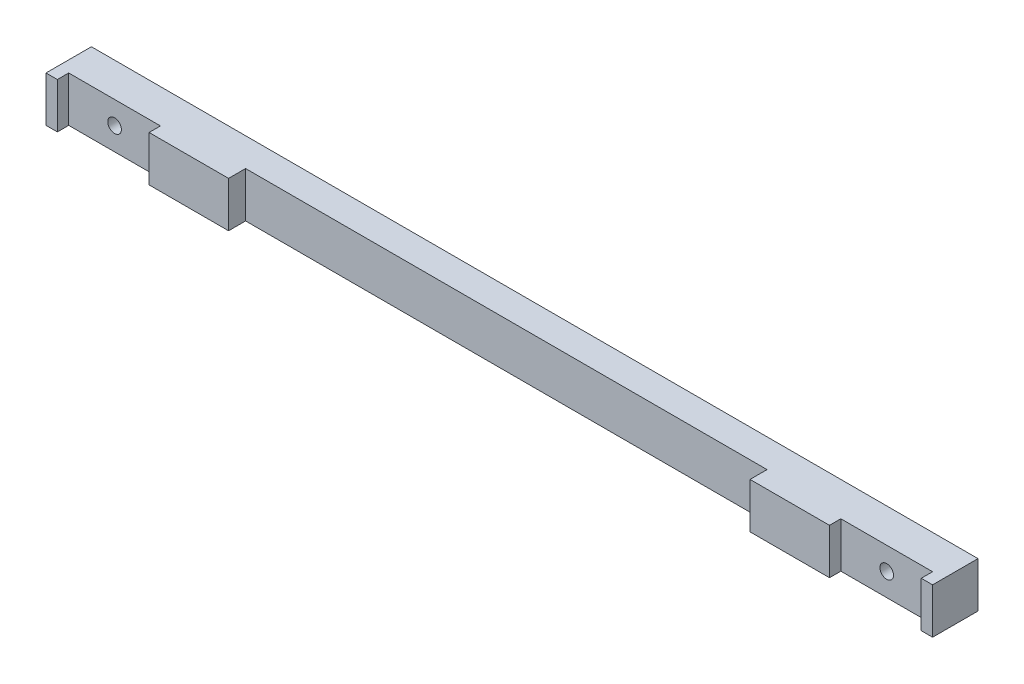
ISO-10303-21;
HEADER;
FILE_DESCRIPTION(('STEP AP214'),'2;1');
FILE_NAME('part.step','',(''),(''),'','','');
FILE_SCHEMA(('AUTOMOTIVE_DESIGN { 1 0 10303 214 1 1 1 1 }'));
ENDSEC;
DATA;
#1=APPLICATION_CONTEXT('core data for automotive mechanical design processes');
#2=APPLICATION_PROTOCOL_DEFINITION('international standard','automotive_design',2000,#1);
#3=PRODUCT_CONTEXT('',#1,'mechanical');
#4=PRODUCT('Part','Part','',(#3));
#5=PRODUCT_RELATED_PRODUCT_CATEGORY('part','',(#4));
#6=PRODUCT_DEFINITION_FORMATION('','',#4);
#7=PRODUCT_DEFINITION_CONTEXT('part definition',#1,'design');
#8=PRODUCT_DEFINITION('design','',#6,#7);
#9=PRODUCT_DEFINITION_SHAPE('','',#8);
#10=(LENGTH_UNIT() NAMED_UNIT(*) SI_UNIT(.MILLI.,.METRE.));
#11=(NAMED_UNIT(*) PLANE_ANGLE_UNIT() SI_UNIT($,.RADIAN.));
#12=(NAMED_UNIT(*) SI_UNIT($,.STERADIAN.) SOLID_ANGLE_UNIT());
#13=UNCERTAINTY_MEASURE_WITH_UNIT(LENGTH_MEASURE(1.E-05),#10,'distance_accuracy_value','');
#14=(GEOMETRIC_REPRESENTATION_CONTEXT(3) GLOBAL_UNCERTAINTY_ASSIGNED_CONTEXT((#13)) GLOBAL_UNIT_ASSIGNED_CONTEXT((#10,
#11,#12)) REPRESENTATION_CONTEXT('',''));
#15=CARTESIAN_POINT('',(0.,0.,0.));
#16=DIRECTION('',(0.,0.,1.));
#17=DIRECTION('',(1.,0.,0.));
#18=AXIS2_PLACEMENT_3D('',#15,#16,#17);
#19=CARTESIAN_POINT('',(0.,0.,12.7));
#20=DIRECTION('',(0.,0.,1.));
#21=DIRECTION('',(1.,0.,0.));
#22=AXIS2_PLACEMENT_3D('',#19,#20,#21);
#23=PLANE('',#22);
#24=DIRECTION('',(0.,-1.,0.));
#25=VECTOR('',#24,1.);
#26=CARTESIAN_POINT('',(-72.9107,-11.2366180876711,12.7));
#27=LINE('',#26,#25);
#28=CARTESIAN_POINT('',(-72.9107,6.35,12.7));
#29=VERTEX_POINT('',#28);
#30=CARTESIAN_POINT('',(-72.9107,-6.35,12.7));
#31=VERTEX_POINT('',#30);
#32=EDGE_CURVE('E156',#29,#31,#27,.T.);
#33=ORIENTED_EDGE('',*,*,#32,.F.);
#34=DIRECTION('',(-1.,0.,0.));
#35=VECTOR('',#34,1.);
#36=CARTESIAN_POINT('',(123.9647,6.35000000000002,12.7));
#37=LINE('',#36,#35);
#38=CARTESIAN_POINT('',(-95.1357,6.35000000000002,12.7));
#39=VERTEX_POINT('',#38);
#40=EDGE_CURVE('E166',#29,#39,#37,.T.);
#41=ORIENTED_EDGE('',*,*,#40,.T.);
#42=DIRECTION('',(0.,1.,0.));
#43=VECTOR('',#42,1.);
#44=CARTESIAN_POINT('',(-95.1357,0.,12.7));
#45=LINE('',#44,#43);
#46=CARTESIAN_POINT('',(-95.1356999999999,-6.35000000000001,12.7));
#47=VERTEX_POINT('',#46);
#48=EDGE_CURVE('E228',#47,#39,#45,.T.);
#49=ORIENTED_EDGE('',*,*,#48,.F.);
#50=DIRECTION('',(1.,0.,0.));
#51=VECTOR('',#50,1.);
#52=CARTESIAN_POINT('',(123.9647,-6.34999999999998,12.7));
#53=LINE('',#52,#51);
#54=EDGE_CURVE('E169',#47,#31,#53,.T.);
#55=ORIENTED_EDGE('',*,*,#54,.T.);
#56=EDGE_LOOP('',(#33,#41,#49,#55));
#57=FACE_BOUND('',#56,.T.);
#58=ADVANCED_FACE('F40',(#57),#23,.T.);
#59=DIRECTION('',(0.,-1.,0.));
#60=VECTOR('',#59,1.);
#61=CARTESIAN_POINT('',(-120.7897,0.,12.7));
#62=LINE('',#61,#60);
#63=CARTESIAN_POINT('',(-120.7897,6.35000000000002,12.7));
#64=VERTEX_POINT('',#63);
#65=CARTESIAN_POINT('',(-120.7897,-6.35000000000001,12.7));
#66=VERTEX_POINT('',#65);
#67=EDGE_CURVE('E231',#64,#66,#62,.T.);
#68=ORIENTED_EDGE('',*,*,#67,.F.);
#69=CARTESIAN_POINT('',(-123.9647,6.34999999999999,12.7));
#70=VERTEX_POINT('',#69);
#71=EDGE_CURVE('E180',#64,#70,#37,.T.);
#72=ORIENTED_EDGE('',*,*,#71,.T.);
#73=DIRECTION('',(0.,-1.,0.));
#74=VECTOR('',#73,1.);
#75=CARTESIAN_POINT('',(-123.9647,-6.35000000000001,12.7));
#76=LINE('',#75,#74);
#77=CARTESIAN_POINT('',(-123.9647,-6.35000000000001,12.7));
#78=VERTEX_POINT('',#77);
#79=EDGE_CURVE('E295',#70,#78,#76,.T.);
#80=ORIENTED_EDGE('',*,*,#79,.T.);
#81=EDGE_CURVE('E300',#78,#66,#53,.T.);
#82=ORIENTED_EDGE('',*,*,#81,.T.);
#83=EDGE_LOOP('',(#68,#72,#80,#82));
#84=FACE_BOUND('',#83,.T.);
#85=ADVANCED_FACE('F418',(#84),#23,.T.);
#86=DIRECTION('',(0.,1.,0.));
#87=VECTOR('',#86,1.);
#88=CARTESIAN_POINT('',(72.9107,-11.2366180876711,12.7));
#89=LINE('',#88,#87);
#90=CARTESIAN_POINT('',(72.9107,-6.35,12.7));
#91=VERTEX_POINT('',#90);
#92=CARTESIAN_POINT('',(72.9107,6.35,12.7));
#93=VERTEX_POINT('',#92);
#94=EDGE_CURVE('E171',#91,#93,#89,.T.);
#95=ORIENTED_EDGE('',*,*,#94,.F.);
#96=CARTESIAN_POINT('',(95.1357,-6.35000000000001,12.7));
#97=VERTEX_POINT('',#96);
#98=EDGE_CURVE('E254',#91,#97,#53,.T.);
#99=ORIENTED_EDGE('',*,*,#98,.T.);
#100=DIRECTION('',(0.,-1.,0.));
#101=VECTOR('',#100,1.);
#102=CARTESIAN_POINT('',(95.1357,0.,12.7));
#103=LINE('',#102,#101);
#104=CARTESIAN_POINT('',(95.1357,6.35000000000001,12.7));
#105=VERTEX_POINT('',#104);
#106=EDGE_CURVE('E224',#105,#97,#103,.T.);
#107=ORIENTED_EDGE('',*,*,#106,.F.);
#108=EDGE_CURVE('E179',#105,#93,#37,.T.);
#109=ORIENTED_EDGE('',*,*,#108,.T.);
#110=EDGE_LOOP('',(#95,#99,#107,#109));
#111=FACE_BOUND('',#110,.T.);
#112=ADVANCED_FACE('F252',(#111),#23,.T.);
#113=CARTESIAN_POINT('',(-123.9647,-6.35000000000001,12.7));
#114=DIRECTION('',(1.,0.,0.));
#115=DIRECTION('',(0.,0.,-1.));
#116=AXIS2_PLACEMENT_3D('',#113,#114,#115);
#117=PLANE('',#116);
#118=DIRECTION('',(0.,-1.,0.));
#119=VECTOR('',#118,1.);
#120=CARTESIAN_POINT('',(-123.9647,-6.35000000000001,0.));
#121=LINE('',#120,#119);
#122=CARTESIAN_POINT('',(-123.9647,6.34999999999999,0.));
#123=VERTEX_POINT('',#122);
#124=CARTESIAN_POINT('',(-123.9647,-6.35000000000001,0.));
#125=VERTEX_POINT('',#124);
#126=EDGE_CURVE('E294',#123,#125,#121,.T.);
#127=ORIENTED_EDGE('',*,*,#126,.T.);
#128=DIRECTION('',(0.,0.,-1.));
#129=VECTOR('',#128,1.);
#130=CARTESIAN_POINT('',(-123.9647,-6.35000000000001,12.7));
#131=LINE('',#130,#129);
#132=EDGE_CURVE('E217',#78,#125,#131,.T.);
#133=ORIENTED_EDGE('',*,*,#132,.F.);
#134=ORIENTED_EDGE('',*,*,#79,.F.);
#135=DIRECTION('',(0.,0.,-1.));
#136=VECTOR('',#135,1.);
#137=CARTESIAN_POINT('',(-123.9647,6.34999999999999,12.7));
#138=LINE('',#137,#136);
#139=EDGE_CURVE('E192',#70,#123,#138,.T.);
#140=ORIENTED_EDGE('',*,*,#139,.T.);
#141=EDGE_LOOP('',(#127,#133,#134,#140));
#142=FACE_BOUND('',#141,.T.);
#143=ADVANCED_FACE('F42',(#142),#117,.F.);
#144=CARTESIAN_POINT('',(123.9647,-6.34999999999998,12.7));
#145=DIRECTION('',(0.,1.,0.));
#146=DIRECTION('',(-1.,0.,0.));
#147=AXIS2_PLACEMENT_3D('',#144,#145,#146);
#148=PLANE('',#147);
#149=DIRECTION('',(1.,0.,0.));
#150=VECTOR('',#149,1.);
#151=CARTESIAN_POINT('',(123.9647,-6.34999999999998,7.9375));
#152=LINE('',#151,#150);
#153=CARTESIAN_POINT('',(-72.9107,-6.35,7.9375));
#154=VERTEX_POINT('',#153);
#155=CARTESIAN_POINT('',(72.9107,-6.35,7.9375));
#156=VERTEX_POINT('',#155);
#157=EDGE_CURVE('E343',#154,#156,#152,.T.);
#158=ORIENTED_EDGE('',*,*,#157,.F.);
#159=DIRECTION('',(0.,0.,1.));
#160=VECTOR('',#159,1.);
#161=CARTESIAN_POINT('',(-72.9107,-6.35000000000001,12.7));
#162=LINE('',#161,#160);
#163=EDGE_CURVE('E333',#154,#31,#162,.T.);
#164=ORIENTED_EDGE('',*,*,#163,.T.);
#165=ORIENTED_EDGE('',*,*,#54,.F.);
#166=DIRECTION('',(0.,0.,-1.));
#167=VECTOR('',#166,1.);
#168=CARTESIAN_POINT('',(-95.1357,-6.35000000000001,12.7));
#169=LINE('',#168,#167);
#170=CARTESIAN_POINT('',(-95.1357,-6.35000000000001,9.525));
#171=VERTEX_POINT('',#170);
#172=EDGE_CURVE('E273',#47,#171,#169,.T.);
#173=ORIENTED_EDGE('',*,*,#172,.T.);
#174=DIRECTION('',(1.,0.,0.));
#175=VECTOR('',#174,1.);
#176=CARTESIAN_POINT('',(123.9647,-6.34999999999998,9.525));
#177=LINE('',#176,#175);
#178=CARTESIAN_POINT('',(-120.7897,-6.35000000000001,9.525));
#179=VERTEX_POINT('',#178);
#180=EDGE_CURVE('E291',#179,#171,#177,.T.);
#181=ORIENTED_EDGE('',*,*,#180,.F.);
#182=DIRECTION('',(0.,0.,1.));
#183=VECTOR('',#182,1.);
#184=CARTESIAN_POINT('',(-120.7897,-6.35000000000001,12.7));
#185=LINE('',#184,#183);
#186=EDGE_CURVE('E285',#179,#66,#185,.T.);
#187=ORIENTED_EDGE('',*,*,#186,.T.);
#188=ORIENTED_EDGE('',*,*,#81,.F.);
#189=ORIENTED_EDGE('',*,*,#132,.T.);
#190=DIRECTION('',(1.,0.,0.));
#191=VECTOR('',#190,1.);
#192=CARTESIAN_POINT('',(123.9647,-6.34999999999998,0.));
#193=LINE('',#192,#191);
#194=CARTESIAN_POINT('',(123.9647,-6.34999999999998,0.));
#195=VERTEX_POINT('',#194);
#196=EDGE_CURVE('E403',#125,#195,#193,.T.);
#197=ORIENTED_EDGE('',*,*,#196,.T.);
#198=DIRECTION('',(0.,0.,-1.));
#199=VECTOR('',#198,1.);
#200=CARTESIAN_POINT('',(123.9647,-6.34999999999998,12.7));
#201=LINE('',#200,#199);
#202=CARTESIAN_POINT('',(123.9647,-6.34999999999998,12.7));
#203=VERTEX_POINT('',#202);
#204=EDGE_CURVE('E208',#203,#195,#201,.T.);
#205=ORIENTED_EDGE('',*,*,#204,.F.);
#206=CARTESIAN_POINT('',(120.7897,-6.34999999999998,12.7));
#207=VERTEX_POINT('',#206);
#208=EDGE_CURVE('E299',#207,#203,#53,.T.);
#209=ORIENTED_EDGE('',*,*,#208,.F.);
#210=DIRECTION('',(0.,0.,-1.));
#211=VECTOR('',#210,1.);
#212=CARTESIAN_POINT('',(120.7897,-6.34999999999998,12.7));
#213=LINE('',#212,#211);
#214=CARTESIAN_POINT('',(120.7897,-6.34999999999999,9.525));
#215=VERTEX_POINT('',#214);
#216=EDGE_CURVE('E64',#207,#215,#213,.T.);
#217=ORIENTED_EDGE('',*,*,#216,.T.);
#218=DIRECTION('',(-1.,0.,0.));
#219=VECTOR('',#218,1.);
#220=CARTESIAN_POINT('',(123.9647,-6.34999999999998,9.525));
#221=LINE('',#220,#219);
#222=CARTESIAN_POINT('',(95.1357,-6.34999999999999,9.525));
#223=VERTEX_POINT('',#222);
#224=EDGE_CURVE('E267',#215,#223,#221,.T.);
#225=ORIENTED_EDGE('',*,*,#224,.T.);
#226=DIRECTION('',(0.,0.,1.));
#227=VECTOR('',#226,1.);
#228=CARTESIAN_POINT('',(95.1357,-6.34999999999999,12.7));
#229=LINE('',#228,#227);
#230=EDGE_CURVE('E259',#223,#97,#229,.T.);
#231=ORIENTED_EDGE('',*,*,#230,.T.);
#232=ORIENTED_EDGE('',*,*,#98,.F.);
#233=DIRECTION('',(0.,0.,-1.));
#234=VECTOR('',#233,1.);
#235=CARTESIAN_POINT('',(72.9107,-6.34999999999999,12.7));
#236=LINE('',#235,#234);
#237=EDGE_CURVE('E340',#91,#156,#236,.T.);
#238=ORIENTED_EDGE('',*,*,#237,.T.);
#239=EDGE_LOOP('',(#158,#164,#165,#173,#181,#187,#188,#189,#197,#205,#209,#217,#225,#231,#232,#238));
#240=FACE_BOUND('',#239,.T.);
#241=ADVANCED_FACE('F265',(#240),#148,.F.);
#242=CARTESIAN_POINT('',(123.9647,-6.34999999999998,12.7));
#243=DIRECTION('',(-1.,0.,0.));
#244=DIRECTION('',(0.,0.,1.));
#245=AXIS2_PLACEMENT_3D('',#242,#243,#244);
#246=PLANE('',#245);
#247=DIRECTION('',(0.,1.,0.));
#248=VECTOR('',#247,1.);
#249=CARTESIAN_POINT('',(123.9647,-6.34999999999998,0.));
#250=LINE('',#249,#248);
#251=CARTESIAN_POINT('',(123.9647,6.35000000000002,0.));
#252=VERTEX_POINT('',#251);
#253=EDGE_CURVE('E313',#195,#252,#250,.T.);
#254=ORIENTED_EDGE('',*,*,#253,.T.);
#255=DIRECTION('',(0.,0.,-1.));
#256=VECTOR('',#255,1.);
#257=CARTESIAN_POINT('',(123.9647,6.35000000000002,12.7));
#258=LINE('',#257,#256);
#259=CARTESIAN_POINT('',(123.9647,6.35000000000002,12.7));
#260=VERTEX_POINT('',#259);
#261=EDGE_CURVE('E198',#260,#252,#258,.T.);
#262=ORIENTED_EDGE('',*,*,#261,.F.);
#263=DIRECTION('',(0.,1.,0.));
#264=VECTOR('',#263,1.);
#265=CARTESIAN_POINT('',(123.9647,-6.34999999999998,12.7));
#266=LINE('',#265,#264);
#267=EDGE_CURVE('E187',#203,#260,#266,.T.);
#268=ORIENTED_EDGE('',*,*,#267,.F.);
#269=ORIENTED_EDGE('',*,*,#204,.T.);
#270=EDGE_LOOP('',(#254,#262,#268,#269));
#271=FACE_BOUND('',#270,.T.);
#272=ADVANCED_FACE('F311',(#271),#246,.F.);
#273=CARTESIAN_POINT('',(123.9647,6.35000000000002,12.7));
#274=DIRECTION('',(0.,-1.,0.));
#275=DIRECTION('',(1.,0.,0.));
#276=AXIS2_PLACEMENT_3D('',#273,#274,#275);
#277=PLANE('',#276);
#278=ORIENTED_EDGE('',*,*,#40,.F.);
#279=DIRECTION('',(0.,0.,-1.));
#280=VECTOR('',#279,1.);
#281=CARTESIAN_POINT('',(-72.9107,6.34999999999999,12.7));
#282=LINE('',#281,#280);
#283=CARTESIAN_POINT('',(-72.9107,6.35,7.9375));
#284=VERTEX_POINT('',#283);
#285=EDGE_CURVE('E11',#29,#284,#282,.T.);
#286=ORIENTED_EDGE('',*,*,#285,.T.);
#287=DIRECTION('',(-1.,0.,0.));
#288=VECTOR('',#287,1.);
#289=CARTESIAN_POINT('',(123.9647,6.35000000000002,7.9375));
#290=LINE('',#289,#288);
#291=CARTESIAN_POINT('',(72.9107,6.35000000000001,7.9375));
#292=VERTEX_POINT('',#291);
#293=EDGE_CURVE('E241',#292,#284,#290,.T.);
#294=ORIENTED_EDGE('',*,*,#293,.F.);
#295=DIRECTION('',(0.,0.,1.));
#296=VECTOR('',#295,1.);
#297=CARTESIAN_POINT('',(72.9107,6.35000000000001,12.7));
#298=LINE('',#297,#296);
#299=EDGE_CURVE('E49',#292,#93,#298,.T.);
#300=ORIENTED_EDGE('',*,*,#299,.T.);
#301=ORIENTED_EDGE('',*,*,#108,.F.);
#302=DIRECTION('',(0.,0.,-1.));
#303=VECTOR('',#302,1.);
#304=CARTESIAN_POINT('',(95.1357,6.35000000000001,12.7));
#305=LINE('',#304,#303);
#306=CARTESIAN_POINT('',(95.1357,6.35000000000001,9.525));
#307=VERTEX_POINT('',#306);
#308=EDGE_CURVE('E261',#105,#307,#305,.T.);
#309=ORIENTED_EDGE('',*,*,#308,.T.);
#310=DIRECTION('',(1.,0.,0.));
#311=VECTOR('',#310,1.);
#312=CARTESIAN_POINT('',(123.9647,6.35000000000002,9.525));
#313=LINE('',#312,#311);
#314=CARTESIAN_POINT('',(120.7897,6.35000000000001,9.525));
#315=VERTEX_POINT('',#314);
#316=EDGE_CURVE('E234',#307,#315,#313,.T.);
#317=ORIENTED_EDGE('',*,*,#316,.T.);
#318=DIRECTION('',(0.,0.,1.));
#319=VECTOR('',#318,1.);
#320=CARTESIAN_POINT('',(120.7897,6.35000000000002,12.7));
#321=LINE('',#320,#319);
#322=CARTESIAN_POINT('',(120.7897,6.35000000000002,12.7));
#323=VERTEX_POINT('',#322);
#324=EDGE_CURVE('E316',#315,#323,#321,.T.);
#325=ORIENTED_EDGE('',*,*,#324,.T.);
#326=EDGE_CURVE('E182',#260,#323,#37,.T.);
#327=ORIENTED_EDGE('',*,*,#326,.F.);
#328=ORIENTED_EDGE('',*,*,#261,.T.);
#329=DIRECTION('',(-1.,0.,0.));
#330=VECTOR('',#329,1.);
#331=CARTESIAN_POINT('',(123.9647,6.35000000000002,0.));
#332=LINE('',#331,#330);
#333=EDGE_CURVE('E211',#252,#123,#332,.T.);
#334=ORIENTED_EDGE('',*,*,#333,.T.);
#335=ORIENTED_EDGE('',*,*,#139,.F.);
#336=ORIENTED_EDGE('',*,*,#71,.F.);
#337=DIRECTION('',(0.,0.,-1.));
#338=VECTOR('',#337,1.);
#339=CARTESIAN_POINT('',(-120.7897,6.34999999999999,12.7));
#340=LINE('',#339,#338);
#341=CARTESIAN_POINT('',(-120.7897,6.34999999999999,9.525));
#342=VERTEX_POINT('',#341);
#343=EDGE_CURVE('E281',#64,#342,#340,.T.);
#344=ORIENTED_EDGE('',*,*,#343,.T.);
#345=DIRECTION('',(-1.,0.,0.));
#346=VECTOR('',#345,1.);
#347=CARTESIAN_POINT('',(123.9647,6.35000000000002,9.525));
#348=LINE('',#347,#346);
#349=CARTESIAN_POINT('',(-95.1357,6.34999999999999,9.525));
#350=VERTEX_POINT('',#349);
#351=EDGE_CURVE('E238',#350,#342,#348,.T.);
#352=ORIENTED_EDGE('',*,*,#351,.F.);
#353=DIRECTION('',(0.,0.,1.));
#354=VECTOR('',#353,1.);
#355=CARTESIAN_POINT('',(-95.1357,6.34999999999999,12.7));
#356=LINE('',#355,#354);
#357=EDGE_CURVE('E177',#350,#39,#356,.T.);
#358=ORIENTED_EDGE('',*,*,#357,.T.);
#359=EDGE_LOOP('',(#278,#286,#294,#300,#301,#309,#317,#325,#327,#328,#334,#335,#336,#344,#352,#358));
#360=FACE_BOUND('',#359,.T.);
#361=ADVANCED_FACE('F175',(#360),#277,.F.);
#362=DIRECTION('',(0.,1.,0.));
#363=VECTOR('',#362,1.);
#364=CARTESIAN_POINT('',(120.7897,0.,12.7));
#365=LINE('',#364,#363);
#366=EDGE_CURVE('E221',#207,#323,#365,.T.);
#367=ORIENTED_EDGE('',*,*,#366,.F.);
#368=ORIENTED_EDGE('',*,*,#208,.T.);
#369=ORIENTED_EDGE('',*,*,#267,.T.);
#370=ORIENTED_EDGE('',*,*,#326,.T.);
#371=EDGE_LOOP('',(#367,#368,#369,#370));
#372=FACE_BOUND('',#371,.T.);
#373=ADVANCED_FACE('F307',(#372),#23,.T.);
#374=CARTESIAN_POINT('',(0.,0.,0.));
#375=DIRECTION('',(0.,0.,1.));
#376=DIRECTION('',(1.,0.,0.));
#377=AXIS2_PLACEMENT_3D('',#374,#375,#376);
#378=PLANE('',#377);
#379=CARTESIAN_POINT('',(-107.9627,0.,0.));
#380=DIRECTION('',(0.,0.,1.));
#381=DIRECTION('',(1.,0.,0.));
#382=AXIS2_PLACEMENT_3D('',#379,#380,#381);
#383=CIRCLE('',#382,1.90500000000001);
#384=CARTESIAN_POINT('',(-106.0577,0.,0.));
#385=VERTEX_POINT('',#384);
#386=EDGE_CURVE('E172',#385,#385,#383,.T.);
#387=ORIENTED_EDGE('',*,*,#386,.T.);
#388=EDGE_LOOP('',(#387));
#389=FACE_BOUND('',#388,.T.);
#390=CARTESIAN_POINT('',(107.9627,0.,0.));
#391=DIRECTION('',(0.,0.,1.));
#392=DIRECTION('',(-1.,0.,0.));
#393=AXIS2_PLACEMENT_3D('',#390,#391,#392);
#394=CIRCLE('',#393,1.90499999999999);
#395=CARTESIAN_POINT('',(106.0577,0.,0.));
#396=VERTEX_POINT('',#395);
#397=EDGE_CURVE('E356',#396,#396,#394,.T.);
#398=ORIENTED_EDGE('',*,*,#397,.T.);
#399=EDGE_LOOP('',(#398));
#400=FACE_BOUND('',#399,.T.);
#401=ORIENTED_EDGE('',*,*,#126,.F.);
#402=ORIENTED_EDGE('',*,*,#333,.F.);
#403=ORIENTED_EDGE('',*,*,#253,.F.);
#404=ORIENTED_EDGE('',*,*,#196,.F.);
#405=EDGE_LOOP('',(#401,#402,#403,#404));
#406=FACE_BOUND('',#405,.T.);
#407=ADVANCED_FACE('F369',(#389,#400,#406),#378,.F.);
#408=CARTESIAN_POINT('',(0.,0.,9.525));
#409=DIRECTION('',(0.,0.,-1.));
#410=DIRECTION('',(-1.,0.,0.));
#411=AXIS2_PLACEMENT_3D('',#408,#409,#410);
#412=PLANE('',#411);
#413=CARTESIAN_POINT('',(107.9627,0.,9.525));
#414=DIRECTION('',(0.,0.,1.));
#415=DIRECTION('',(-1.,0.,0.));
#416=AXIS2_PLACEMENT_3D('',#413,#414,#415);
#417=CIRCLE('',#416,1.90499999999999);
#418=CARTESIAN_POINT('',(106.0577,0.,9.525));
#419=VERTEX_POINT('',#418);
#420=EDGE_CURVE('E352',#419,#419,#417,.T.);
#421=ORIENTED_EDGE('',*,*,#420,.F.);
#422=EDGE_LOOP('',(#421));
#423=FACE_BOUND('',#422,.T.);
#424=DIRECTION('',(0.,1.,0.));
#425=VECTOR('',#424,1.);
#426=CARTESIAN_POINT('',(120.7897,-10.7142324933145,9.525));
#427=LINE('',#426,#425);
#428=EDGE_CURVE('E328',#215,#315,#427,.T.);
#429=ORIENTED_EDGE('',*,*,#428,.T.);
#430=ORIENTED_EDGE('',*,*,#316,.F.);
#431=DIRECTION('',(0.,-1.,0.));
#432=VECTOR('',#431,1.);
#433=CARTESIAN_POINT('',(95.1357,-10.7142324933145,9.525));
#434=LINE('',#433,#432);
#435=EDGE_CURVE('E331',#307,#223,#434,.T.);
#436=ORIENTED_EDGE('',*,*,#435,.T.);
#437=ORIENTED_EDGE('',*,*,#224,.F.);
#438=EDGE_LOOP('',(#429,#430,#436,#437));
#439=FACE_BOUND('',#438,.T.);
#440=ADVANCED_FACE('F440',(#423,#439),#412,.F.);
#441=CARTESIAN_POINT('',(95.1357,-10.7142324933145,9.525));
#442=DIRECTION('',(-1.,0.,0.));
#443=DIRECTION('',(0.,0.,1.));
#444=AXIS2_PLACEMENT_3D('',#441,#442,#443);
#445=PLANE('',#444);
#446=ORIENTED_EDGE('',*,*,#435,.F.);
#447=ORIENTED_EDGE('',*,*,#308,.F.);
#448=ORIENTED_EDGE('',*,*,#106,.T.);
#449=ORIENTED_EDGE('',*,*,#230,.F.);
#450=EDGE_LOOP('',(#446,#447,#448,#449));
#451=FACE_BOUND('',#450,.T.);
#452=ADVANCED_FACE('F258',(#451),#445,.F.);
#453=CARTESIAN_POINT('',(120.7897,-10.7142324933145,9.525));
#454=DIRECTION('',(1.,0.,0.));
#455=DIRECTION('',(0.,0.,-1.));
#456=AXIS2_PLACEMENT_3D('',#453,#454,#455);
#457=PLANE('',#456);
#458=ORIENTED_EDGE('',*,*,#366,.T.);
#459=ORIENTED_EDGE('',*,*,#324,.F.);
#460=ORIENTED_EDGE('',*,*,#428,.F.);
#461=ORIENTED_EDGE('',*,*,#216,.F.);
#462=EDGE_LOOP('',(#458,#459,#460,#461));
#463=FACE_BOUND('',#462,.T.);
#464=ADVANCED_FACE('F384',(#463),#457,.F.);
#465=CARTESIAN_POINT('',(0.,0.,9.525));
#466=DIRECTION('',(0.,0.,1.));
#467=DIRECTION('',(1.,0.,0.));
#468=AXIS2_PLACEMENT_3D('',#465,#466,#467);
#469=PLANE('',#468);
#470=CARTESIAN_POINT('',(-107.9627,0.,9.525));
#471=DIRECTION('',(0.,0.,1.));
#472=DIRECTION('',(1.,0.,0.));
#473=AXIS2_PLACEMENT_3D('',#470,#471,#472);
#474=CIRCLE('',#473,1.90500000000001);
#475=CARTESIAN_POINT('',(-106.0577,0.,9.525));
#476=VERTEX_POINT('',#475);
#477=EDGE_CURVE('E360',#476,#476,#474,.T.);
#478=ORIENTED_EDGE('',*,*,#477,.F.);
#479=EDGE_LOOP('',(#478));
#480=FACE_BOUND('',#479,.T.);
#481=ORIENTED_EDGE('',*,*,#180,.T.);
#482=DIRECTION('',(0.,1.,0.));
#483=VECTOR('',#482,1.);
#484=CARTESIAN_POINT('',(-95.1357,-10.7142324933145,9.525));
#485=LINE('',#484,#483);
#486=EDGE_CURVE('E319',#171,#350,#485,.T.);
#487=ORIENTED_EDGE('',*,*,#486,.T.);
#488=ORIENTED_EDGE('',*,*,#351,.T.);
#489=DIRECTION('',(0.,-1.,0.));
#490=VECTOR('',#489,1.);
#491=CARTESIAN_POINT('',(-120.7897,-10.7142324933145,9.525));
#492=LINE('',#491,#490);
#493=EDGE_CURVE('E325',#342,#179,#492,.T.);
#494=ORIENTED_EDGE('',*,*,#493,.T.);
#495=EDGE_LOOP('',(#481,#487,#488,#494));
#496=FACE_BOUND('',#495,.T.);
#497=ADVANCED_FACE('F380',(#480,#496),#469,.T.);
#498=CARTESIAN_POINT('',(-120.7897,-10.7142324933145,9.525));
#499=DIRECTION('',(-1.,0.,0.));
#500=DIRECTION('',(0.,0.,1.));
#501=AXIS2_PLACEMENT_3D('',#498,#499,#500);
#502=PLANE('',#501);
#503=ORIENTED_EDGE('',*,*,#493,.F.);
#504=ORIENTED_EDGE('',*,*,#343,.F.);
#505=ORIENTED_EDGE('',*,*,#67,.T.);
#506=ORIENTED_EDGE('',*,*,#186,.F.);
#507=EDGE_LOOP('',(#503,#504,#505,#506));
#508=FACE_BOUND('',#507,.T.);
#509=ADVANCED_FACE('F383',(#508),#502,.F.);
#510=CARTESIAN_POINT('',(-95.1357,-10.7142324933145,9.525));
#511=DIRECTION('',(1.,0.,0.));
#512=DIRECTION('',(0.,0.,-1.));
#513=AXIS2_PLACEMENT_3D('',#510,#511,#512);
#514=PLANE('',#513);
#515=ORIENTED_EDGE('',*,*,#48,.T.);
#516=ORIENTED_EDGE('',*,*,#357,.F.);
#517=ORIENTED_EDGE('',*,*,#486,.F.);
#518=ORIENTED_EDGE('',*,*,#172,.F.);
#519=EDGE_LOOP('',(#515,#516,#517,#518));
#520=FACE_BOUND('',#519,.T.);
#521=ADVANCED_FACE('F390',(#520),#514,.F.);
#522=CARTESIAN_POINT('',(-72.9107,-11.2366180876711,7.9375));
#523=DIRECTION('',(-1.,0.,0.));
#524=DIRECTION('',(0.,0.,1.));
#525=AXIS2_PLACEMENT_3D('',#522,#523,#524);
#526=PLANE('',#525);
#527=DIRECTION('',(0.,-1.,0.));
#528=VECTOR('',#527,1.);
#529=CARTESIAN_POINT('',(-72.9107,-11.2366180876711,7.9375));
#530=LINE('',#529,#528);
#531=EDGE_CURVE('E159',#284,#154,#530,.T.);
#532=ORIENTED_EDGE('',*,*,#531,.F.);
#533=ORIENTED_EDGE('',*,*,#285,.F.);
#534=ORIENTED_EDGE('',*,*,#32,.T.);
#535=ORIENTED_EDGE('',*,*,#163,.F.);
#536=EDGE_LOOP('',(#532,#533,#534,#535));
#537=FACE_BOUND('',#536,.T.);
#538=ADVANCED_FACE('F155',(#537),#526,.F.);
#539=CARTESIAN_POINT('',(72.9107,-11.2366180876711,7.9375));
#540=DIRECTION('',(1.,0.,0.));
#541=DIRECTION('',(0.,0.,-1.));
#542=AXIS2_PLACEMENT_3D('',#539,#540,#541);
#543=PLANE('',#542);
#544=ORIENTED_EDGE('',*,*,#94,.T.);
#545=ORIENTED_EDGE('',*,*,#299,.F.);
#546=DIRECTION('',(0.,1.,0.));
#547=VECTOR('',#546,1.);
#548=CARTESIAN_POINT('',(72.9107,-11.2366180876711,7.9375));
#549=LINE('',#548,#547);
#550=EDGE_CURVE('E56',#156,#292,#549,.T.);
#551=ORIENTED_EDGE('',*,*,#550,.F.);
#552=ORIENTED_EDGE('',*,*,#237,.F.);
#553=EDGE_LOOP('',(#544,#545,#551,#552));
#554=FACE_BOUND('',#553,.T.);
#555=ADVANCED_FACE('F522',(#554),#543,.F.);
#556=CARTESIAN_POINT('',(0.,0.,7.9375));
#557=DIRECTION('',(0.,0.,1.));
#558=DIRECTION('',(1.,0.,0.));
#559=AXIS2_PLACEMENT_3D('',#556,#557,#558);
#560=PLANE('',#559);
#561=ORIENTED_EDGE('',*,*,#157,.T.);
#562=ORIENTED_EDGE('',*,*,#550,.T.);
#563=ORIENTED_EDGE('',*,*,#293,.T.);
#564=ORIENTED_EDGE('',*,*,#531,.T.);
#565=EDGE_LOOP('',(#561,#562,#563,#564));
#566=FACE_BOUND('',#565,.T.);
#567=ADVANCED_FACE('F376',(#566),#560,.T.);
#568=CARTESIAN_POINT('',(-107.9627,0.,0.));
#569=DIRECTION('',(0.,0.,1.));
#570=DIRECTION('',(1.,0.,0.));
#571=AXIS2_PLACEMENT_3D('',#568,#569,#570);
#572=CYLINDRICAL_SURFACE('',#571,1.90500000000001);
#573=ORIENTED_EDGE('',*,*,#386,.F.);
#574=EDGE_LOOP('',(#573));
#575=FACE_BOUND('',#574,.T.);
#576=ORIENTED_EDGE('',*,*,#477,.T.);
#577=EDGE_LOOP('',(#576));
#578=FACE_BOUND('',#577,.T.);
#579=ADVANCED_FACE('F372',(#575,#578),#572,.F.);
#580=CARTESIAN_POINT('',(107.9627,0.,0.));
#581=DIRECTION('',(0.,0.,1.));
#582=DIRECTION('',(1.,0.,0.));
#583=AXIS2_PLACEMENT_3D('',#580,#581,#582);
#584=CYLINDRICAL_SURFACE('',#583,1.90499999999999);
#585=ORIENTED_EDGE('',*,*,#397,.F.);
#586=EDGE_LOOP('',(#585));
#587=FACE_BOUND('',#586,.T.);
#588=ORIENTED_EDGE('',*,*,#420,.T.);
#589=EDGE_LOOP('',(#588));
#590=FACE_BOUND('',#589,.T.);
#591=ADVANCED_FACE('F375',(#587,#590),#584,.F.);
#592=CLOSED_SHELL('',(#58,#85,#112,#143,#241,#272,#361,#373,#407,#440,#452,#464,#497,#509,#521,
#538,#555,#567,#579,#591));
#593=MANIFOLD_SOLID_BREP('B2',#592);
#594=ADVANCED_BREP_SHAPE_REPRESENTATION('',(#18,#593),#14);
#595=SHAPE_DEFINITION_REPRESENTATION(#9,#594);
ENDSEC;
END-ISO-10303-21;
